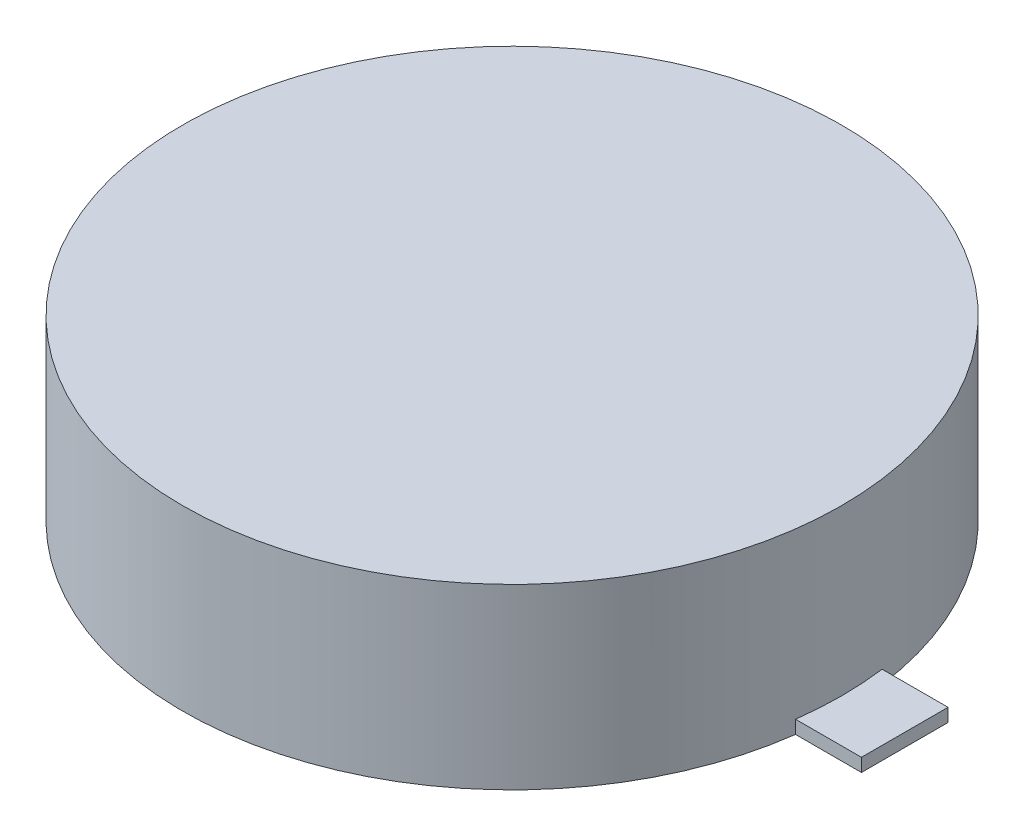
ISO-10303-21;
HEADER;
FILE_DESCRIPTION(('STEP AP214'),'2;1');
FILE_NAME('part.step','',(''),(''),'','','');
FILE_SCHEMA(('AUTOMOTIVE_DESIGN { 1 0 10303 214 1 1 1 1 }'));
ENDSEC;
DATA;
#1=APPLICATION_CONTEXT('core data for automotive mechanical design processes');
#2=APPLICATION_PROTOCOL_DEFINITION('international standard','automotive_design',2000,#1);
#3=PRODUCT_CONTEXT('',#1,'mechanical');
#4=PRODUCT('Part','Part','',(#3));
#5=PRODUCT_RELATED_PRODUCT_CATEGORY('part','',(#4));
#6=PRODUCT_DEFINITION_FORMATION('','',#4);
#7=PRODUCT_DEFINITION_CONTEXT('part definition',#1,'design');
#8=PRODUCT_DEFINITION('design','',#6,#7);
#9=PRODUCT_DEFINITION_SHAPE('','',#8);
#10=(LENGTH_UNIT() NAMED_UNIT(*) SI_UNIT(.MILLI.,.METRE.));
#11=(NAMED_UNIT(*) PLANE_ANGLE_UNIT() SI_UNIT($,.RADIAN.));
#12=(NAMED_UNIT(*) SI_UNIT($,.STERADIAN.) SOLID_ANGLE_UNIT());
#13=UNCERTAINTY_MEASURE_WITH_UNIT(LENGTH_MEASURE(1.E-05),#10,'distance_accuracy_value','');
#14=(GEOMETRIC_REPRESENTATION_CONTEXT(3) GLOBAL_UNCERTAINTY_ASSIGNED_CONTEXT((#13)) GLOBAL_UNIT_ASSIGNED_CONTEXT((#10,
#11,#12)) REPRESENTATION_CONTEXT('',''));
#15=CARTESIAN_POINT('',(0.,0.,0.));
#16=DIRECTION('',(0.,0.,1.));
#17=DIRECTION('',(1.,0.,0.));
#18=AXIS2_PLACEMENT_3D('',#15,#16,#17);
#19=CARTESIAN_POINT('',(0.,2.7,0.));
#20=DIRECTION('',(0.,-1.,0.));
#21=DIRECTION('',(0.,0.,-1.));
#22=AXIS2_PLACEMENT_3D('',#19,#20,#21);
#23=CYLINDRICAL_SURFACE('',#22,5.);
#24=CARTESIAN_POINT('',(0.,2.7,0.));
#25=DIRECTION('',(0.,1.,0.));
#26=DIRECTION('',(0.,0.,1.));
#27=AXIS2_PLACEMENT_3D('',#24,#25,#26);
#28=CIRCLE('',#27,5.);
#29=CARTESIAN_POINT('',(0.,2.7,5.));
#30=VERTEX_POINT('',#29);
#31=EDGE_CURVE('E51',#30,#30,#28,.T.);
#32=ORIENTED_EDGE('',*,*,#31,.F.);
#33=EDGE_LOOP('',(#32));
#34=FACE_BOUND('',#33,.T.);
#35=DIRECTION('',(0.,-1.,0.));
#36=VECTOR('',#35,1.);
#37=CARTESIAN_POINT('',(4.95667150488306,0.2,0.656816254884332));
#38=LINE('',#37,#36);
#39=CARTESIAN_POINT('',(4.95667150488306,0.2,0.656816254884329));
#40=VERTEX_POINT('',#39);
#41=CARTESIAN_POINT('',(4.95667150488306,0.,0.656816254884332));
#42=VERTEX_POINT('',#41);
#43=EDGE_CURVE('E61',#40,#42,#38,.T.);
#44=ORIENTED_EDGE('',*,*,#43,.F.);
#45=CARTESIAN_POINT('',(0.,0.2,0.));
#46=DIRECTION('',(0.,1.,0.));
#47=DIRECTION('',(0.,0.,1.));
#48=AXIS2_PLACEMENT_3D('',#45,#46,#47);
#49=CIRCLE('',#48,5.);
#50=CARTESIAN_POINT('',(4.95667150488306,0.2,-0.656816254884329));
#51=VERTEX_POINT('',#50);
#52=EDGE_CURVE('E11',#40,#51,#49,.T.);
#53=ORIENTED_EDGE('',*,*,#52,.T.);
#54=DIRECTION('',(0.,-1.,0.));
#55=VECTOR('',#54,1.);
#56=CARTESIAN_POINT('',(4.95667150488306,0.2,-0.656816254884332));
#57=LINE('',#56,#55);
#58=CARTESIAN_POINT('',(4.95667150488306,0.,-0.656816254884332));
#59=VERTEX_POINT('',#58);
#60=EDGE_CURVE('E107',#51,#59,#57,.T.);
#61=ORIENTED_EDGE('',*,*,#60,.T.);
#62=CARTESIAN_POINT('',(0.,0.,0.));
#63=DIRECTION('',(0.,1.,0.));
#64=DIRECTION('',(0.,0.,1.));
#65=AXIS2_PLACEMENT_3D('',#62,#63,#64);
#66=CIRCLE('',#65,5.);
#67=EDGE_CURVE('E124',#59,#42,#66,.T.);
#68=ORIENTED_EDGE('',*,*,#67,.T.);
#69=EDGE_LOOP('',(#44,#53,#61,#68));
#70=FACE_BOUND('',#69,.T.);
#71=ADVANCED_FACE('F43',(#34,#70),#23,.T.);
#72=CARTESIAN_POINT('',(0.,2.7,0.));
#73=DIRECTION('',(0.,1.,0.));
#74=DIRECTION('',(0.,0.,1.));
#75=AXIS2_PLACEMENT_3D('',#72,#73,#74);
#76=PLANE('',#75);
#77=ORIENTED_EDGE('',*,*,#31,.T.);
#78=EDGE_LOOP('',(#77));
#79=FACE_BOUND('',#78,.T.);
#80=ADVANCED_FACE('F143',(#79),#76,.T.);
#81=CARTESIAN_POINT('',(0.,0.,0.));
#82=DIRECTION('',(0.,1.,0.));
#83=DIRECTION('',(0.,0.,1.));
#84=AXIS2_PLACEMENT_3D('',#81,#82,#83);
#85=PLANE('',#84);
#86=ORIENTED_EDGE('',*,*,#67,.F.);
#87=DIRECTION('',(-1.,0.,0.));
#88=VECTOR('',#87,1.);
#89=CARTESIAN_POINT('',(4.95667150488306,0.,-0.656816254884332));
#90=LINE('',#89,#88);
#91=CARTESIAN_POINT('',(5.95667150488306,0.,-0.656816254884332));
#92=VERTEX_POINT('',#91);
#93=EDGE_CURVE('E88',#92,#59,#90,.T.);
#94=ORIENTED_EDGE('',*,*,#93,.F.);
#95=DIRECTION('',(0.,0.,-1.));
#96=VECTOR('',#95,1.);
#97=CARTESIAN_POINT('',(5.95667150488306,0.,-0.656816254884332));
#98=LINE('',#97,#96);
#99=CARTESIAN_POINT('',(5.95667150488306,0.,0.656816254884332));
#100=VERTEX_POINT('',#99);
#101=EDGE_CURVE('E112',#100,#92,#98,.T.);
#102=ORIENTED_EDGE('',*,*,#101,.F.);
#103=DIRECTION('',(1.,0.,0.));
#104=VECTOR('',#103,1.);
#105=CARTESIAN_POINT('',(4.95667150488306,0.,0.656816254884332));
#106=LINE('',#105,#104);
#107=EDGE_CURVE('E94',#42,#100,#106,.T.);
#108=ORIENTED_EDGE('',*,*,#107,.F.);
#109=EDGE_LOOP('',(#86,#94,#102,#108));
#110=FACE_BOUND('',#109,.T.);
#111=ADVANCED_FACE('F131',(#110),#85,.F.);
#112=CARTESIAN_POINT('',(4.95667150488306,0.2,0.656816254884332));
#113=DIRECTION('',(0.,0.,-1.));
#114=DIRECTION('',(-1.,0.,0.));
#115=AXIS2_PLACEMENT_3D('',#112,#113,#114);
#116=PLANE('',#115);
#117=ORIENTED_EDGE('',*,*,#107,.T.);
#118=DIRECTION('',(0.,-1.,0.));
#119=VECTOR('',#118,1.);
#120=CARTESIAN_POINT('',(5.95667150488306,0.2,0.656816254884332));
#121=LINE('',#120,#119);
#122=CARTESIAN_POINT('',(5.95667150488306,0.2,0.656816254884332));
#123=VERTEX_POINT('',#122);
#124=EDGE_CURVE('E91',#123,#100,#121,.T.);
#125=ORIENTED_EDGE('',*,*,#124,.F.);
#126=DIRECTION('',(1.,0.,0.));
#127=VECTOR('',#126,1.);
#128=CARTESIAN_POINT('',(4.95667150488306,0.2,0.656816254884332));
#129=LINE('',#128,#127);
#130=EDGE_CURVE('E80',#40,#123,#129,.T.);
#131=ORIENTED_EDGE('',*,*,#130,.F.);
#132=ORIENTED_EDGE('',*,*,#43,.T.);
#133=EDGE_LOOP('',(#117,#125,#131,#132));
#134=FACE_BOUND('',#133,.T.);
#135=ADVANCED_FACE('F92',(#134),#116,.F.);
#136=CARTESIAN_POINT('',(5.95667150488306,0.2,-0.656816254884332));
#137=DIRECTION('',(-1.,0.,0.));
#138=DIRECTION('',(0.,0.,1.));
#139=AXIS2_PLACEMENT_3D('',#136,#137,#138);
#140=PLANE('',#139);
#141=ORIENTED_EDGE('',*,*,#101,.T.);
#142=DIRECTION('',(0.,-1.,0.));
#143=VECTOR('',#142,1.);
#144=CARTESIAN_POINT('',(5.95667150488306,0.2,-0.656816254884332));
#145=LINE('',#144,#143);
#146=CARTESIAN_POINT('',(5.95667150488306,0.2,-0.656816254884332));
#147=VERTEX_POINT('',#146);
#148=EDGE_CURVE('E98',#147,#92,#145,.T.);
#149=ORIENTED_EDGE('',*,*,#148,.F.);
#150=DIRECTION('',(0.,0.,-1.));
#151=VECTOR('',#150,1.);
#152=CARTESIAN_POINT('',(5.95667150488306,0.2,-0.656816254884332));
#153=LINE('',#152,#151);
#154=EDGE_CURVE('E84',#123,#147,#153,.T.);
#155=ORIENTED_EDGE('',*,*,#154,.F.);
#156=ORIENTED_EDGE('',*,*,#124,.T.);
#157=EDGE_LOOP('',(#141,#149,#155,#156));
#158=FACE_BOUND('',#157,.T.);
#159=ADVANCED_FACE('F100',(#158),#140,.F.);
#160=CARTESIAN_POINT('',(4.95667150488306,0.2,-0.656816254884332));
#161=DIRECTION('',(0.,0.,1.));
#162=DIRECTION('',(1.,0.,0.));
#163=AXIS2_PLACEMENT_3D('',#160,#161,#162);
#164=PLANE('',#163);
#165=ORIENTED_EDGE('',*,*,#93,.T.);
#166=ORIENTED_EDGE('',*,*,#60,.F.);
#167=DIRECTION('',(-1.,0.,0.));
#168=VECTOR('',#167,1.);
#169=CARTESIAN_POINT('',(4.95667150488306,0.2,-0.656816254884332));
#170=LINE('',#169,#168);
#171=EDGE_CURVE('E104',#147,#51,#170,.T.);
#172=ORIENTED_EDGE('',*,*,#171,.F.);
#173=ORIENTED_EDGE('',*,*,#148,.T.);
#174=EDGE_LOOP('',(#165,#166,#172,#173));
#175=FACE_BOUND('',#174,.T.);
#176=ADVANCED_FACE('F133',(#175),#164,.F.);
#177=CARTESIAN_POINT('',(0.,0.2,0.));
#178=DIRECTION('',(0.,1.,0.));
#179=DIRECTION('',(0.,0.,1.));
#180=AXIS2_PLACEMENT_3D('',#177,#178,#179);
#181=PLANE('',#180);
#182=ORIENTED_EDGE('',*,*,#52,.F.);
#183=ORIENTED_EDGE('',*,*,#130,.T.);
#184=ORIENTED_EDGE('',*,*,#154,.T.);
#185=ORIENTED_EDGE('',*,*,#171,.T.);
#186=EDGE_LOOP('',(#182,#183,#184,#185));
#187=FACE_BOUND('',#186,.T.);
#188=ADVANCED_FACE('F82',(#187),#181,.T.);
#189=CLOSED_SHELL('',(#71,#80,#111,#135,#159,#176,#188));
#190=MANIFOLD_SOLID_BREP('B2',#189);
#191=ADVANCED_BREP_SHAPE_REPRESENTATION('',(#18,#190),#14);
#192=SHAPE_DEFINITION_REPRESENTATION(#9,#191);
ENDSEC;
END-ISO-10303-21;
